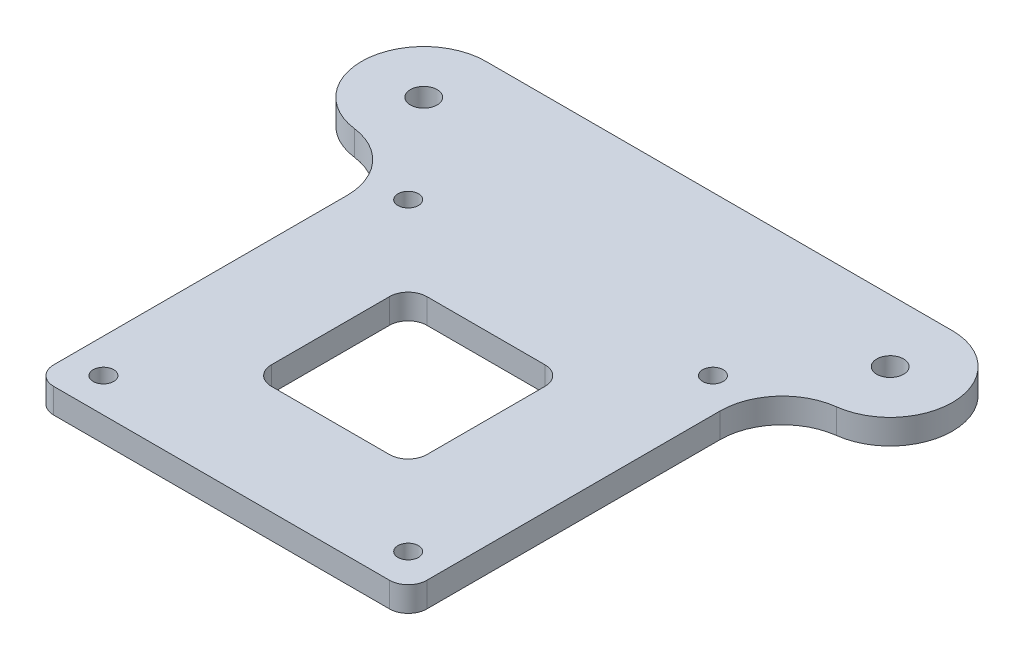
ISO-10303-21;
HEADER;
FILE_DESCRIPTION(('STEP AP214'),'2;1');
FILE_NAME('part.step','',(''),(''),'','','');
FILE_SCHEMA(('AUTOMOTIVE_DESIGN { 1 0 10303 214 1 1 1 1 }'));
ENDSEC;
DATA;
#1=APPLICATION_CONTEXT('core data for automotive mechanical design processes');
#2=APPLICATION_PROTOCOL_DEFINITION('international standard','automotive_design',2000,#1);
#3=PRODUCT_CONTEXT('',#1,'mechanical');
#4=PRODUCT('Part','Part','',(#3));
#5=PRODUCT_RELATED_PRODUCT_CATEGORY('part','',(#4));
#6=PRODUCT_DEFINITION_FORMATION('','',#4);
#7=PRODUCT_DEFINITION_CONTEXT('part definition',#1,'design');
#8=PRODUCT_DEFINITION('design','',#6,#7);
#9=PRODUCT_DEFINITION_SHAPE('','',#8);
#10=(LENGTH_UNIT() NAMED_UNIT(*) SI_UNIT(.MILLI.,.METRE.));
#11=(NAMED_UNIT(*) PLANE_ANGLE_UNIT() SI_UNIT($,.RADIAN.));
#12=(NAMED_UNIT(*) SI_UNIT($,.STERADIAN.) SOLID_ANGLE_UNIT());
#13=UNCERTAINTY_MEASURE_WITH_UNIT(LENGTH_MEASURE(1.E-05),#10,'distance_accuracy_value','');
#14=(GEOMETRIC_REPRESENTATION_CONTEXT(3) GLOBAL_UNCERTAINTY_ASSIGNED_CONTEXT((#13)) GLOBAL_UNIT_ASSIGNED_CONTEXT((#10,
#11,#12)) REPRESENTATION_CONTEXT('',''));
#15=CARTESIAN_POINT('',(0.,0.,0.));
#16=DIRECTION('',(0.,0.,1.));
#17=DIRECTION('',(1.,0.,0.));
#18=AXIS2_PLACEMENT_3D('',#15,#16,#17);
#19=CARTESIAN_POINT('',(0.,4.,0.));
#20=DIRECTION('',(0.,-1.,0.));
#21=DIRECTION('',(0.,0.,-1.));
#22=AXIS2_PLACEMENT_3D('',#19,#20,#21);
#23=PLANE('',#22);
#24=DIRECTION('',(0.,0.,-1.));
#25=VECTOR('',#24,1.);
#26=CARTESIAN_POINT('',(-12.5,4.,0.));
#27=LINE('',#26,#25);
#28=CARTESIAN_POINT('',(-12.5,4.,9.5));
#29=VERTEX_POINT('',#28);
#30=CARTESIAN_POINT('',(-12.5,4.,-9.5));
#31=VERTEX_POINT('',#30);
#32=EDGE_CURVE('E316',#29,#31,#27,.T.);
#33=ORIENTED_EDGE('',*,*,#32,.T.);
#34=CARTESIAN_POINT('',(-9.5,4.,-9.5));
#35=DIRECTION('',(0.,-1.,0.));
#36=DIRECTION('',(0.,0.,-1.));
#37=AXIS2_PLACEMENT_3D('',#34,#35,#36);
#38=CIRCLE('',#37,3.);
#39=CARTESIAN_POINT('',(-9.5,4.,-12.5));
#40=VERTEX_POINT('',#39);
#41=EDGE_CURVE('E45',#31,#40,#38,.T.);
#42=ORIENTED_EDGE('',*,*,#41,.T.);
#43=DIRECTION('',(1.,0.,0.));
#44=VECTOR('',#43,1.);
#45=CARTESIAN_POINT('',(0.,4.,-12.5));
#46=LINE('',#45,#44);
#47=CARTESIAN_POINT('',(9.5,4.,-12.5));
#48=VERTEX_POINT('',#47);
#49=EDGE_CURVE('E315',#40,#48,#46,.T.);
#50=ORIENTED_EDGE('',*,*,#49,.T.);
#51=CARTESIAN_POINT('',(9.5,4.,-9.5));
#52=DIRECTION('',(0.,-1.,0.));
#53=DIRECTION('',(0.,0.,-1.));
#54=AXIS2_PLACEMENT_3D('',#51,#52,#53);
#55=CIRCLE('',#54,3.);
#56=CARTESIAN_POINT('',(12.5,4.,-9.5));
#57=VERTEX_POINT('',#56);
#58=EDGE_CURVE('E303',#48,#57,#55,.T.);
#59=ORIENTED_EDGE('',*,*,#58,.T.);
#60=DIRECTION('',(0.,0.,1.));
#61=VECTOR('',#60,1.);
#62=CARTESIAN_POINT('',(12.5,4.,0.));
#63=LINE('',#62,#61);
#64=CARTESIAN_POINT('',(12.5,4.,9.5));
#65=VERTEX_POINT('',#64);
#66=EDGE_CURVE('E204',#57,#65,#63,.T.);
#67=ORIENTED_EDGE('',*,*,#66,.T.);
#68=CARTESIAN_POINT('',(9.5,4.,9.5));
#69=DIRECTION('',(0.,-1.,0.));
#70=DIRECTION('',(0.,0.,-1.));
#71=AXIS2_PLACEMENT_3D('',#68,#69,#70);
#72=CIRCLE('',#71,3.);
#73=CARTESIAN_POINT('',(9.5,4.,12.5));
#74=VERTEX_POINT('',#73);
#75=EDGE_CURVE('E307',#65,#74,#72,.T.);
#76=ORIENTED_EDGE('',*,*,#75,.T.);
#77=DIRECTION('',(-1.,0.,0.));
#78=VECTOR('',#77,1.);
#79=CARTESIAN_POINT('',(0.,4.,12.5));
#80=LINE('',#79,#78);
#81=CARTESIAN_POINT('',(-9.5,4.,12.5));
#82=VERTEX_POINT('',#81);
#83=EDGE_CURVE('E344',#74,#82,#80,.T.);
#84=ORIENTED_EDGE('',*,*,#83,.T.);
#85=CARTESIAN_POINT('',(-9.5,4.,9.5));
#86=DIRECTION('',(0.,-1.,0.));
#87=DIRECTION('',(0.,0.,-1.));
#88=AXIS2_PLACEMENT_3D('',#85,#86,#87);
#89=CIRCLE('',#88,3.);
#90=EDGE_CURVE('E59',#82,#29,#89,.T.);
#91=ORIENTED_EDGE('',*,*,#90,.T.);
#92=EDGE_LOOP('',(#33,#42,#50,#59,#67,#76,#84,#91));
#93=FACE_BOUND('',#92,.T.);
#94=DIRECTION('',(1.,0.,0.));
#95=VECTOR('',#94,1.);
#96=CARTESIAN_POINT('',(-30.,4.,30.));
#97=LINE('',#96,#95);
#98=CARTESIAN_POINT('',(-27.,4.,30.));
#99=VERTEX_POINT('',#98);
#100=CARTESIAN_POINT('',(27.,4.,30.));
#101=VERTEX_POINT('',#100);
#102=EDGE_CURVE('E239',#99,#101,#97,.T.);
#103=ORIENTED_EDGE('',*,*,#102,.T.);
#104=CARTESIAN_POINT('',(27.,4.,27.));
#105=DIRECTION('',(0.,-1.,0.));
#106=DIRECTION('',(0.,0.,-1.));
#107=AXIS2_PLACEMENT_3D('',#104,#105,#106);
#108=CIRCLE('',#107,3.);
#109=CARTESIAN_POINT('',(30.,4.,27.));
#110=VERTEX_POINT('',#109);
#111=EDGE_CURVE('E280',#101,#110,#108,.F.);
#112=ORIENTED_EDGE('',*,*,#111,.T.);
#113=DIRECTION('',(0.,0.,-1.));
#114=VECTOR('',#113,1.);
#115=CARTESIAN_POINT('',(30.,4.,30.));
#116=LINE('',#115,#114);
#117=CARTESIAN_POINT('',(30.,4.,-20.1568651670155));
#118=VERTEX_POINT('',#117);
#119=EDGE_CURVE('E233',#110,#118,#116,.T.);
#120=ORIENTED_EDGE('',*,*,#119,.T.);
#121=CARTESIAN_POINT('',(40.,4.,-20.1568651670156));
#122=DIRECTION('',(0.,-1.,0.));
#123=DIRECTION('',(0.,0.,-1.));
#124=AXIS2_PLACEMENT_3D('',#121,#122,#123);
#125=CIRCLE('',#124,10.);
#126=CARTESIAN_POINT('',(38.75,4.,-30.0784325835078));
#127=VERTEX_POINT('',#126);
#128=EDGE_CURVE('E260',#118,#127,#125,.T.);
#129=ORIENTED_EDGE('',*,*,#128,.T.);
#130=CARTESIAN_POINT('',(37.5,4.,-40.));
#131=DIRECTION('',(0.,1.,0.));
#132=DIRECTION('',(0.,0.,1.));
#133=AXIS2_PLACEMENT_3D('',#130,#131,#132);
#134=CIRCLE('',#133,10.);
#135=CARTESIAN_POINT('',(37.5,4.,-50.));
#136=VERTEX_POINT('',#135);
#137=EDGE_CURVE('E182',#127,#136,#134,.T.);
#138=ORIENTED_EDGE('',*,*,#137,.T.);
#139=DIRECTION('',(1.,0.,0.));
#140=VECTOR('',#139,1.);
#141=CARTESIAN_POINT('',(0.,4.,-50.));
#142=LINE('',#141,#140);
#143=CARTESIAN_POINT('',(-37.5,4.,-50.));
#144=VERTEX_POINT('',#143);
#145=EDGE_CURVE('E167',#144,#136,#142,.T.);
#146=ORIENTED_EDGE('',*,*,#145,.F.);
#147=CARTESIAN_POINT('',(-37.5,4.,-40.));
#148=DIRECTION('',(0.,1.,0.));
#149=DIRECTION('',(0.,0.,1.));
#150=AXIS2_PLACEMENT_3D('',#147,#148,#149);
#151=CIRCLE('',#150,10.);
#152=CARTESIAN_POINT('',(-38.75,4.,-30.0784325835078));
#153=VERTEX_POINT('',#152);
#154=EDGE_CURVE('E179',#144,#153,#151,.T.);
#155=ORIENTED_EDGE('',*,*,#154,.T.);
#156=CARTESIAN_POINT('',(-40.,4.,-20.1568651670156));
#157=DIRECTION('',(0.,-1.,0.));
#158=DIRECTION('',(0.,0.,-1.));
#159=AXIS2_PLACEMENT_3D('',#156,#157,#158);
#160=CIRCLE('',#159,10.);
#161=CARTESIAN_POINT('',(-30.,4.,-20.1568651670155));
#162=VERTEX_POINT('',#161);
#163=EDGE_CURVE('E264',#153,#162,#160,.T.);
#164=ORIENTED_EDGE('',*,*,#163,.T.);
#165=DIRECTION('',(0.,0.,1.));
#166=VECTOR('',#165,1.);
#167=CARTESIAN_POINT('',(-30.,4.,30.));
#168=LINE('',#167,#166);
#169=CARTESIAN_POINT('',(-30.,4.,27.));
#170=VERTEX_POINT('',#169);
#171=EDGE_CURVE('E235',#162,#170,#168,.T.);
#172=ORIENTED_EDGE('',*,*,#171,.T.);
#173=CARTESIAN_POINT('',(-27.,4.,27.));
#174=DIRECTION('',(0.,-1.,0.));
#175=DIRECTION('',(0.,0.,-1.));
#176=AXIS2_PLACEMENT_3D('',#173,#174,#175);
#177=CIRCLE('',#176,3.);
#178=EDGE_CURVE('E278',#170,#99,#177,.F.);
#179=ORIENTED_EDGE('',*,*,#178,.T.);
#180=EDGE_LOOP('',(#103,#112,#120,#129,#138,#146,#155,#164,#172,#179));
#181=FACE_BOUND('',#180,.T.);
#182=CARTESIAN_POINT('',(-24.5,4.,-24.5));
#183=DIRECTION('',(0.,1.,0.));
#184=DIRECTION('',(0.,0.,1.));
#185=AXIS2_PLACEMENT_3D('',#182,#183,#184);
#186=CIRCLE('',#185,1.65);
#187=CARTESIAN_POINT('',(-24.5,4.,-22.85));
#188=VERTEX_POINT('',#187);
#189=EDGE_CURVE('E227',#188,#188,#186,.T.);
#190=ORIENTED_EDGE('',*,*,#189,.F.);
#191=EDGE_LOOP('',(#190));
#192=FACE_BOUND('',#191,.T.);
#193=CARTESIAN_POINT('',(24.5,4.,-24.5));
#194=DIRECTION('',(0.,1.,0.));
#195=DIRECTION('',(0.,0.,1.));
#196=AXIS2_PLACEMENT_3D('',#193,#194,#195);
#197=CIRCLE('',#196,1.65);
#198=CARTESIAN_POINT('',(24.5,4.,-22.85));
#199=VERTEX_POINT('',#198);
#200=EDGE_CURVE('E221',#199,#199,#197,.T.);
#201=ORIENTED_EDGE('',*,*,#200,.F.);
#202=EDGE_LOOP('',(#201));
#203=FACE_BOUND('',#202,.T.);
#204=CARTESIAN_POINT('',(-24.5,4.,24.5));
#205=DIRECTION('',(0.,1.,0.));
#206=DIRECTION('',(0.,0.,1.));
#207=AXIS2_PLACEMENT_3D('',#204,#205,#206);
#208=CIRCLE('',#207,1.65);
#209=CARTESIAN_POINT('',(-24.5,4.,26.15));
#210=VERTEX_POINT('',#209);
#211=EDGE_CURVE('E215',#210,#210,#208,.T.);
#212=ORIENTED_EDGE('',*,*,#211,.F.);
#213=EDGE_LOOP('',(#212));
#214=FACE_BOUND('',#213,.T.);
#215=CARTESIAN_POINT('',(24.5,4.,24.5));
#216=DIRECTION('',(0.,1.,0.));
#217=DIRECTION('',(0.,0.,1.));
#218=AXIS2_PLACEMENT_3D('',#215,#216,#217);
#219=CIRCLE('',#218,1.65);
#220=CARTESIAN_POINT('',(24.5,4.,26.15));
#221=VERTEX_POINT('',#220);
#222=EDGE_CURVE('E209',#221,#221,#219,.T.);
#223=ORIENTED_EDGE('',*,*,#222,.F.);
#224=EDGE_LOOP('',(#223));
#225=FACE_BOUND('',#224,.T.);
#226=CARTESIAN_POINT('',(-37.5,4.,-40.));
#227=DIRECTION('',(0.,1.,0.));
#228=DIRECTION('',(0.,0.,1.));
#229=AXIS2_PLACEMENT_3D('',#226,#227,#228);
#230=CIRCLE('',#229,2.15);
#231=CARTESIAN_POINT('',(-37.5,4.,-37.85));
#232=VERTEX_POINT('',#231);
#233=EDGE_CURVE('E193',#232,#232,#230,.T.);
#234=ORIENTED_EDGE('',*,*,#233,.F.);
#235=EDGE_LOOP('',(#234));
#236=FACE_BOUND('',#235,.T.);
#237=CARTESIAN_POINT('',(37.5,4.,-40.));
#238=DIRECTION('',(0.,1.,0.));
#239=DIRECTION('',(0.,0.,1.));
#240=AXIS2_PLACEMENT_3D('',#237,#238,#239);
#241=CIRCLE('',#240,2.15);
#242=CARTESIAN_POINT('',(37.5,4.,-37.85));
#243=VERTEX_POINT('',#242);
#244=EDGE_CURVE('E196',#243,#243,#241,.T.);
#245=ORIENTED_EDGE('',*,*,#244,.F.);
#246=EDGE_LOOP('',(#245));
#247=FACE_BOUND('',#246,.T.);
#248=ADVANCED_FACE('F37',(#93,#181,#192,#203,#214,#225,#236,#247),#23,.F.);
#249=CARTESIAN_POINT('',(0.,0.,0.));
#250=DIRECTION('',(0.,-1.,0.));
#251=DIRECTION('',(0.,0.,-1.));
#252=AXIS2_PLACEMENT_3D('',#249,#250,#251);
#253=PLANE('',#252);
#254=DIRECTION('',(1.,0.,0.));
#255=VECTOR('',#254,1.);
#256=CARTESIAN_POINT('',(-12.5,0.,12.5));
#257=LINE('',#256,#255);
#258=CARTESIAN_POINT('',(-9.5,0.,12.5));
#259=VERTEX_POINT('',#258);
#260=CARTESIAN_POINT('',(9.5,0.,12.5));
#261=VERTEX_POINT('',#260);
#262=EDGE_CURVE('E322',#259,#261,#257,.T.);
#263=ORIENTED_EDGE('',*,*,#262,.T.);
#264=CARTESIAN_POINT('',(9.5,0.,9.5));
#265=DIRECTION('',(0.,-1.,0.));
#266=DIRECTION('',(0.,0.,-1.));
#267=AXIS2_PLACEMENT_3D('',#264,#265,#266);
#268=CIRCLE('',#267,3.);
#269=CARTESIAN_POINT('',(12.5,0.,9.5));
#270=VERTEX_POINT('',#269);
#271=EDGE_CURVE('E309',#261,#270,#268,.F.);
#272=ORIENTED_EDGE('',*,*,#271,.T.);
#273=DIRECTION('',(0.,0.,-1.));
#274=VECTOR('',#273,1.);
#275=CARTESIAN_POINT('',(12.5,0.,12.5));
#276=LINE('',#275,#274);
#277=CARTESIAN_POINT('',(12.5,0.,-9.5));
#278=VERTEX_POINT('',#277);
#279=EDGE_CURVE('E339',#270,#278,#276,.T.);
#280=ORIENTED_EDGE('',*,*,#279,.T.);
#281=CARTESIAN_POINT('',(9.5,0.,-9.5));
#282=DIRECTION('',(0.,-1.,0.));
#283=DIRECTION('',(0.,0.,-1.));
#284=AXIS2_PLACEMENT_3D('',#281,#282,#283);
#285=CIRCLE('',#284,3.);
#286=CARTESIAN_POINT('',(9.5,0.,-12.5));
#287=VERTEX_POINT('',#286);
#288=EDGE_CURVE('E305',#278,#287,#285,.F.);
#289=ORIENTED_EDGE('',*,*,#288,.T.);
#290=DIRECTION('',(-1.,0.,0.));
#291=VECTOR('',#290,1.);
#292=CARTESIAN_POINT('',(-12.5,0.,-12.5));
#293=LINE('',#292,#291);
#294=CARTESIAN_POINT('',(-9.5,0.,-12.5));
#295=VERTEX_POINT('',#294);
#296=EDGE_CURVE('E333',#287,#295,#293,.T.);
#297=ORIENTED_EDGE('',*,*,#296,.T.);
#298=CARTESIAN_POINT('',(-9.5,0.,-9.5));
#299=DIRECTION('',(0.,-1.,0.));
#300=DIRECTION('',(0.,0.,-1.));
#301=AXIS2_PLACEMENT_3D('',#298,#299,#300);
#302=CIRCLE('',#301,3.);
#303=CARTESIAN_POINT('',(-12.5,0.,-9.5));
#304=VERTEX_POINT('',#303);
#305=EDGE_CURVE('E11',#295,#304,#302,.F.);
#306=ORIENTED_EDGE('',*,*,#305,.T.);
#307=DIRECTION('',(0.,0.,1.));
#308=VECTOR('',#307,1.);
#309=CARTESIAN_POINT('',(-12.5,0.,12.5));
#310=LINE('',#309,#308);
#311=CARTESIAN_POINT('',(-12.5,0.,9.5));
#312=VERTEX_POINT('',#311);
#313=EDGE_CURVE('E331',#304,#312,#310,.T.);
#314=ORIENTED_EDGE('',*,*,#313,.T.);
#315=CARTESIAN_POINT('',(-9.5,0.,9.5));
#316=DIRECTION('',(0.,-1.,0.));
#317=DIRECTION('',(0.,0.,-1.));
#318=AXIS2_PLACEMENT_3D('',#315,#316,#317);
#319=CIRCLE('',#318,3.);
#320=EDGE_CURVE('E312',#312,#259,#319,.F.);
#321=ORIENTED_EDGE('',*,*,#320,.T.);
#322=EDGE_LOOP('',(#263,#272,#280,#289,#297,#306,#314,#321));
#323=FACE_BOUND('',#322,.T.);
#324=CARTESIAN_POINT('',(-24.5,0.,24.5));
#325=DIRECTION('',(0.,1.,0.));
#326=DIRECTION('',(0.,0.,1.));
#327=AXIS2_PLACEMENT_3D('',#324,#325,#326);
#328=CIRCLE('',#327,1.65);
#329=CARTESIAN_POINT('',(-24.5,0.,26.15));
#330=VERTEX_POINT('',#329);
#331=EDGE_CURVE('E212',#330,#330,#328,.T.);
#332=ORIENTED_EDGE('',*,*,#331,.T.);
#333=EDGE_LOOP('',(#332));
#334=FACE_BOUND('',#333,.T.);
#335=CARTESIAN_POINT('',(-24.5,0.,-24.5));
#336=DIRECTION('',(0.,1.,0.));
#337=DIRECTION('',(0.,0.,1.));
#338=AXIS2_PLACEMENT_3D('',#335,#336,#337);
#339=CIRCLE('',#338,1.65);
#340=CARTESIAN_POINT('',(-24.5,0.,-22.85));
#341=VERTEX_POINT('',#340);
#342=EDGE_CURVE('E224',#341,#341,#339,.T.);
#343=ORIENTED_EDGE('',*,*,#342,.T.);
#344=EDGE_LOOP('',(#343));
#345=FACE_BOUND('',#344,.T.);
#346=DIRECTION('',(0.,0.,-1.));
#347=VECTOR('',#346,1.);
#348=CARTESIAN_POINT('',(30.,0.,30.));
#349=LINE('',#348,#347);
#350=CARTESIAN_POINT('',(30.,0.,27.));
#351=VERTEX_POINT('',#350);
#352=CARTESIAN_POINT('',(30.,0.,-20.1568651670155));
#353=VERTEX_POINT('',#352);
#354=EDGE_CURVE('E230',#351,#353,#349,.T.);
#355=ORIENTED_EDGE('',*,*,#354,.F.);
#356=CARTESIAN_POINT('',(27.,0.,27.));
#357=DIRECTION('',(0.,-1.,0.));
#358=DIRECTION('',(0.,0.,-1.));
#359=AXIS2_PLACEMENT_3D('',#356,#357,#358);
#360=CIRCLE('',#359,3.);
#361=CARTESIAN_POINT('',(27.,0.,30.));
#362=VERTEX_POINT('',#361);
#363=EDGE_CURVE('E271',#351,#362,#360,.T.);
#364=ORIENTED_EDGE('',*,*,#363,.T.);
#365=DIRECTION('',(1.,0.,0.));
#366=VECTOR('',#365,1.);
#367=CARTESIAN_POINT('',(-30.,0.,30.));
#368=LINE('',#367,#366);
#369=CARTESIAN_POINT('',(-27.,0.,30.));
#370=VERTEX_POINT('',#369);
#371=EDGE_CURVE('E236',#370,#362,#368,.T.);
#372=ORIENTED_EDGE('',*,*,#371,.F.);
#373=CARTESIAN_POINT('',(-27.,0.,27.));
#374=DIRECTION('',(0.,-1.,0.));
#375=DIRECTION('',(0.,0.,-1.));
#376=AXIS2_PLACEMENT_3D('',#373,#374,#375);
#377=CIRCLE('',#376,3.);
#378=CARTESIAN_POINT('',(-30.,0.,27.));
#379=VERTEX_POINT('',#378);
#380=EDGE_CURVE('E269',#370,#379,#377,.T.);
#381=ORIENTED_EDGE('',*,*,#380,.T.);
#382=DIRECTION('',(0.,0.,1.));
#383=VECTOR('',#382,1.);
#384=CARTESIAN_POINT('',(-30.,0.,30.));
#385=LINE('',#384,#383);
#386=CARTESIAN_POINT('',(-30.,0.,-20.1568651670155));
#387=VERTEX_POINT('',#386);
#388=EDGE_CURVE('E243',#387,#379,#385,.T.);
#389=ORIENTED_EDGE('',*,*,#388,.F.);
#390=CARTESIAN_POINT('',(-40.,0.,-20.1568651670156));
#391=DIRECTION('',(0.,-1.,0.));
#392=DIRECTION('',(0.,0.,-1.));
#393=AXIS2_PLACEMENT_3D('',#390,#391,#392);
#394=CIRCLE('',#393,10.);
#395=CARTESIAN_POINT('',(-38.75,0.,-30.0784325835078));
#396=VERTEX_POINT('',#395);
#397=EDGE_CURVE('E262',#387,#396,#394,.F.);
#398=ORIENTED_EDGE('',*,*,#397,.T.);
#399=CARTESIAN_POINT('',(-37.5,0.,-40.));
#400=DIRECTION('',(0.,-1.,0.));
#401=DIRECTION('',(0.,0.,-1.));
#402=AXIS2_PLACEMENT_3D('',#399,#400,#401);
#403=CIRCLE('',#402,10.);
#404=CARTESIAN_POINT('',(-37.5,0.,-50.));
#405=VERTEX_POINT('',#404);
#406=EDGE_CURVE('E173',#405,#396,#403,.F.);
#407=ORIENTED_EDGE('',*,*,#406,.F.);
#408=DIRECTION('',(1.,0.,0.));
#409=VECTOR('',#408,1.);
#410=CARTESIAN_POINT('',(0.,0.,-50.));
#411=LINE('',#410,#409);
#412=CARTESIAN_POINT('',(37.5,0.,-50.));
#413=VERTEX_POINT('',#412);
#414=EDGE_CURVE('E169',#405,#413,#411,.T.);
#415=ORIENTED_EDGE('',*,*,#414,.T.);
#416=CARTESIAN_POINT('',(37.5,0.,-40.));
#417=DIRECTION('',(0.,-1.,0.));
#418=DIRECTION('',(0.,0.,-1.));
#419=AXIS2_PLACEMENT_3D('',#416,#417,#418);
#420=CIRCLE('',#419,10.);
#421=CARTESIAN_POINT('',(38.75,0.,-30.0784325835078));
#422=VERTEX_POINT('',#421);
#423=EDGE_CURVE('E184',#422,#413,#420,.F.);
#424=ORIENTED_EDGE('',*,*,#423,.F.);
#425=CARTESIAN_POINT('',(40.,0.,-20.1568651670156));
#426=DIRECTION('',(0.,-1.,0.));
#427=DIRECTION('',(0.,0.,-1.));
#428=AXIS2_PLACEMENT_3D('',#425,#426,#427);
#429=CIRCLE('',#428,10.);
#430=EDGE_CURVE('E257',#422,#353,#429,.F.);
#431=ORIENTED_EDGE('',*,*,#430,.T.);
#432=EDGE_LOOP('',(#355,#364,#372,#381,#389,#398,#407,#415,#424,#431));
#433=FACE_BOUND('',#432,.T.);
#434=CARTESIAN_POINT('',(24.5,0.,-24.5));
#435=DIRECTION('',(0.,1.,0.));
#436=DIRECTION('',(0.,0.,1.));
#437=AXIS2_PLACEMENT_3D('',#434,#435,#436);
#438=CIRCLE('',#437,1.65);
#439=CARTESIAN_POINT('',(24.5,0.,-22.85));
#440=VERTEX_POINT('',#439);
#441=EDGE_CURVE('E218',#440,#440,#438,.T.);
#442=ORIENTED_EDGE('',*,*,#441,.T.);
#443=EDGE_LOOP('',(#442));
#444=FACE_BOUND('',#443,.T.);
#445=CARTESIAN_POINT('',(24.5,0.,24.5));
#446=DIRECTION('',(0.,1.,0.));
#447=DIRECTION('',(0.,0.,1.));
#448=AXIS2_PLACEMENT_3D('',#445,#446,#447);
#449=CIRCLE('',#448,1.65);
#450=CARTESIAN_POINT('',(24.5,0.,26.15));
#451=VERTEX_POINT('',#450);
#452=EDGE_CURVE('E201',#451,#451,#449,.T.);
#453=ORIENTED_EDGE('',*,*,#452,.T.);
#454=EDGE_LOOP('',(#453));
#455=FACE_BOUND('',#454,.T.);
#456=CARTESIAN_POINT('',(37.5,0.,-40.));
#457=DIRECTION('',(0.,-1.,0.));
#458=DIRECTION('',(0.,0.,-1.));
#459=AXIS2_PLACEMENT_3D('',#456,#457,#458);
#460=CIRCLE('',#459,2.15);
#461=CARTESIAN_POINT('',(37.5,0.,-42.15));
#462=VERTEX_POINT('',#461);
#463=EDGE_CURVE('E199',#462,#462,#460,.F.);
#464=ORIENTED_EDGE('',*,*,#463,.T.);
#465=EDGE_LOOP('',(#464));
#466=FACE_BOUND('',#465,.T.);
#467=CARTESIAN_POINT('',(-37.5,0.,-40.));
#468=DIRECTION('',(0.,-1.,0.));
#469=DIRECTION('',(0.,0.,-1.));
#470=AXIS2_PLACEMENT_3D('',#467,#468,#469);
#471=CIRCLE('',#470,2.15);
#472=CARTESIAN_POINT('',(-37.5,0.,-42.15));
#473=VERTEX_POINT('',#472);
#474=EDGE_CURVE('E189',#473,#473,#471,.F.);
#475=ORIENTED_EDGE('',*,*,#474,.T.);
#476=EDGE_LOOP('',(#475));
#477=FACE_BOUND('',#476,.T.);
#478=ADVANCED_FACE('F329',(#323,#334,#345,#433,#444,#455,#466,#477),#253,.T.);
#479=CARTESIAN_POINT('',(30.,4.,30.));
#480=DIRECTION('',(-1.,0.,0.));
#481=DIRECTION('',(0.,0.,1.));
#482=AXIS2_PLACEMENT_3D('',#479,#480,#481);
#483=PLANE('',#482);
#484=ORIENTED_EDGE('',*,*,#119,.F.);
#485=DIRECTION('',(0.,-1.,0.));
#486=VECTOR('',#485,1.);
#487=CARTESIAN_POINT('',(30.,4.,27.));
#488=LINE('',#487,#486);
#489=EDGE_CURVE('E266',#110,#351,#488,.T.);
#490=ORIENTED_EDGE('',*,*,#489,.T.);
#491=ORIENTED_EDGE('',*,*,#354,.T.);
#492=DIRECTION('',(0.,1.,0.));
#493=VECTOR('',#492,1.);
#494=CARTESIAN_POINT('',(30.,4.,-20.1568651670155));
#495=LINE('',#494,#493);
#496=EDGE_CURVE('E250',#353,#118,#495,.T.);
#497=ORIENTED_EDGE('',*,*,#496,.T.);
#498=EDGE_LOOP('',(#484,#490,#491,#497));
#499=FACE_BOUND('',#498,.T.);
#500=ADVANCED_FACE('F361',(#499),#483,.F.);
#501=CARTESIAN_POINT('',(-30.,4.,30.));
#502=DIRECTION('',(1.,0.,0.));
#503=DIRECTION('',(0.,0.,-1.));
#504=AXIS2_PLACEMENT_3D('',#501,#502,#503);
#505=PLANE('',#504);
#506=ORIENTED_EDGE('',*,*,#388,.T.);
#507=DIRECTION('',(0.,-1.,0.));
#508=VECTOR('',#507,1.);
#509=CARTESIAN_POINT('',(-30.,4.,27.));
#510=LINE('',#509,#508);
#511=EDGE_CURVE('E282',#379,#170,#510,.F.);
#512=ORIENTED_EDGE('',*,*,#511,.T.);
#513=ORIENTED_EDGE('',*,*,#171,.F.);
#514=DIRECTION('',(0.,1.,0.));
#515=VECTOR('',#514,1.);
#516=CARTESIAN_POINT('',(-30.,4.,-20.1568651670155));
#517=LINE('',#516,#515);
#518=EDGE_CURVE('E253',#162,#387,#517,.F.);
#519=ORIENTED_EDGE('',*,*,#518,.T.);
#520=EDGE_LOOP('',(#506,#512,#513,#519));
#521=FACE_BOUND('',#520,.T.);
#522=ADVANCED_FACE('F370',(#521),#505,.F.);
#523=CARTESIAN_POINT('',(-30.,4.,30.));
#524=DIRECTION('',(0.,0.,-1.));
#525=DIRECTION('',(-1.,0.,0.));
#526=AXIS2_PLACEMENT_3D('',#523,#524,#525);
#527=PLANE('',#526);
#528=ORIENTED_EDGE('',*,*,#371,.T.);
#529=DIRECTION('',(0.,-1.,0.));
#530=VECTOR('',#529,1.);
#531=CARTESIAN_POINT('',(27.,4.,30.));
#532=LINE('',#531,#530);
#533=EDGE_CURVE('E276',#362,#101,#532,.F.);
#534=ORIENTED_EDGE('',*,*,#533,.T.);
#535=ORIENTED_EDGE('',*,*,#102,.F.);
#536=DIRECTION('',(0.,-1.,0.));
#537=VECTOR('',#536,1.);
#538=CARTESIAN_POINT('',(-27.,4.,30.));
#539=LINE('',#538,#537);
#540=EDGE_CURVE('E273',#99,#370,#539,.T.);
#541=ORIENTED_EDGE('',*,*,#540,.T.);
#542=EDGE_LOOP('',(#528,#534,#535,#541));
#543=FACE_BOUND('',#542,.T.);
#544=ADVANCED_FACE('F367',(#543),#527,.F.);
#545=CARTESIAN_POINT('',(-24.5,4.,-24.5));
#546=DIRECTION('',(0.,-1.,0.));
#547=DIRECTION('',(0.,0.,-1.));
#548=AXIS2_PLACEMENT_3D('',#545,#546,#547);
#549=CYLINDRICAL_SURFACE('',#548,1.65);
#550=ORIENTED_EDGE('',*,*,#189,.T.);
#551=EDGE_LOOP('',(#550));
#552=FACE_BOUND('',#551,.T.);
#553=ORIENTED_EDGE('',*,*,#342,.F.);
#554=EDGE_LOOP('',(#553));
#555=FACE_BOUND('',#554,.T.);
#556=ADVANCED_FACE('F364',(#552,#555),#549,.F.);
#557=CARTESIAN_POINT('',(24.5,4.,-24.5));
#558=DIRECTION('',(0.,-1.,0.));
#559=DIRECTION('',(0.,0.,-1.));
#560=AXIS2_PLACEMENT_3D('',#557,#558,#559);
#561=CYLINDRICAL_SURFACE('',#560,1.65);
#562=ORIENTED_EDGE('',*,*,#200,.T.);
#563=EDGE_LOOP('',(#562));
#564=FACE_BOUND('',#563,.T.);
#565=ORIENTED_EDGE('',*,*,#441,.F.);
#566=EDGE_LOOP('',(#565));
#567=FACE_BOUND('',#566,.T.);
#568=ADVANCED_FACE('F450',(#564,#567),#561,.F.);
#569=CARTESIAN_POINT('',(-24.5,4.,24.5));
#570=DIRECTION('',(0.,-1.,0.));
#571=DIRECTION('',(0.,0.,-1.));
#572=AXIS2_PLACEMENT_3D('',#569,#570,#571);
#573=CYLINDRICAL_SURFACE('',#572,1.65);
#574=ORIENTED_EDGE('',*,*,#211,.T.);
#575=EDGE_LOOP('',(#574));
#576=FACE_BOUND('',#575,.T.);
#577=ORIENTED_EDGE('',*,*,#331,.F.);
#578=EDGE_LOOP('',(#577));
#579=FACE_BOUND('',#578,.T.);
#580=ADVANCED_FACE('F447',(#576,#579),#573,.F.);
#581=CARTESIAN_POINT('',(24.5,4.,24.5));
#582=DIRECTION('',(0.,-1.,0.));
#583=DIRECTION('',(0.,0.,-1.));
#584=AXIS2_PLACEMENT_3D('',#581,#582,#583);
#585=CYLINDRICAL_SURFACE('',#584,1.65);
#586=ORIENTED_EDGE('',*,*,#222,.T.);
#587=EDGE_LOOP('',(#586));
#588=FACE_BOUND('',#587,.T.);
#589=ORIENTED_EDGE('',*,*,#452,.F.);
#590=EDGE_LOOP('',(#589));
#591=FACE_BOUND('',#590,.T.);
#592=ADVANCED_FACE('F442',(#588,#591),#585,.F.);
#593=CARTESIAN_POINT('',(-37.5,-124.197423483742,-40.));
#594=DIRECTION('',(0.,1.,0.));
#595=DIRECTION('',(0.,0.,1.));
#596=AXIS2_PLACEMENT_3D('',#593,#594,#595);
#597=CYLINDRICAL_SURFACE('',#596,10.);
#598=ORIENTED_EDGE('',*,*,#406,.T.);
#599=DIRECTION('',(0.,1.,0.));
#600=VECTOR('',#599,1.);
#601=CARTESIAN_POINT('',(-38.75,-124.197423483742,-30.0784325835078));
#602=LINE('',#601,#600);
#603=EDGE_CURVE('E188',#396,#153,#602,.T.);
#604=ORIENTED_EDGE('',*,*,#603,.T.);
#605=ORIENTED_EDGE('',*,*,#154,.F.);
#606=DIRECTION('',(0.,1.,0.));
#607=VECTOR('',#606,1.);
#608=CARTESIAN_POINT('',(-37.5,-124.197423483742,-50.));
#609=LINE('',#608,#607);
#610=EDGE_CURVE('E163',#405,#144,#609,.T.);
#611=ORIENTED_EDGE('',*,*,#610,.F.);
#612=EDGE_LOOP('',(#598,#604,#605,#611));
#613=FACE_BOUND('',#612,.T.);
#614=ADVANCED_FACE('F186',(#613),#597,.T.);
#615=CARTESIAN_POINT('',(0.,-124.197423483742,-50.));
#616=DIRECTION('',(0.,0.,1.));
#617=DIRECTION('',(1.,0.,0.));
#618=AXIS2_PLACEMENT_3D('',#615,#616,#617);
#619=PLANE('',#618);
#620=ORIENTED_EDGE('',*,*,#414,.F.);
#621=ORIENTED_EDGE('',*,*,#610,.T.);
#622=ORIENTED_EDGE('',*,*,#145,.T.);
#623=DIRECTION('',(0.,1.,0.));
#624=VECTOR('',#623,1.);
#625=CARTESIAN_POINT('',(37.5,-124.197423483742,-50.));
#626=LINE('',#625,#624);
#627=EDGE_CURVE('E206',#413,#136,#626,.T.);
#628=ORIENTED_EDGE('',*,*,#627,.F.);
#629=EDGE_LOOP('',(#620,#621,#622,#628));
#630=FACE_BOUND('',#629,.T.);
#631=ADVANCED_FACE('F165',(#630),#619,.F.);
#632=CARTESIAN_POINT('',(37.5,-124.197423483742,-40.));
#633=DIRECTION('',(0.,1.,0.));
#634=DIRECTION('',(0.,0.,1.));
#635=AXIS2_PLACEMENT_3D('',#632,#633,#634);
#636=CYLINDRICAL_SURFACE('',#635,10.);
#637=ORIENTED_EDGE('',*,*,#137,.F.);
#638=DIRECTION('',(0.,1.,0.));
#639=VECTOR('',#638,1.);
#640=CARTESIAN_POINT('',(38.75,-124.197423483742,-30.0784325835078));
#641=LINE('',#640,#639);
#642=EDGE_CURVE('E241',#127,#422,#641,.F.);
#643=ORIENTED_EDGE('',*,*,#642,.T.);
#644=ORIENTED_EDGE('',*,*,#423,.T.);
#645=ORIENTED_EDGE('',*,*,#627,.T.);
#646=EDGE_LOOP('',(#637,#643,#644,#645));
#647=FACE_BOUND('',#646,.T.);
#648=ADVANCED_FACE('F434',(#647),#636,.T.);
#649=CARTESIAN_POINT('',(37.5,-124.197423483742,-40.));
#650=DIRECTION('',(0.,1.,0.));
#651=DIRECTION('',(0.,0.,1.));
#652=AXIS2_PLACEMENT_3D('',#649,#650,#651);
#653=CYLINDRICAL_SURFACE('',#652,2.15);
#654=ORIENTED_EDGE('',*,*,#244,.T.);
#655=EDGE_LOOP('',(#654));
#656=FACE_BOUND('',#655,.T.);
#657=ORIENTED_EDGE('',*,*,#463,.F.);
#658=EDGE_LOOP('',(#657));
#659=FACE_BOUND('',#658,.T.);
#660=ADVANCED_FACE('F353',(#656,#659),#653,.F.);
#661=CARTESIAN_POINT('',(-37.5,-124.197423483742,-40.));
#662=DIRECTION('',(0.,1.,0.));
#663=DIRECTION('',(0.,0.,1.));
#664=AXIS2_PLACEMENT_3D('',#661,#662,#663);
#665=CYLINDRICAL_SURFACE('',#664,2.15);
#666=ORIENTED_EDGE('',*,*,#233,.T.);
#667=EDGE_LOOP('',(#666));
#668=FACE_BOUND('',#667,.T.);
#669=ORIENTED_EDGE('',*,*,#474,.F.);
#670=EDGE_LOOP('',(#669));
#671=FACE_BOUND('',#670,.T.);
#672=ADVANCED_FACE('F382',(#668,#671),#665,.F.);
#673=CARTESIAN_POINT('',(40.,-124.197423483742,-20.1568651670156));
#674=DIRECTION('',(0.,1.,0.));
#675=DIRECTION('',(0.,0.,1.));
#676=AXIS2_PLACEMENT_3D('',#673,#674,#675);
#677=CYLINDRICAL_SURFACE('',#676,10.);
#678=ORIENTED_EDGE('',*,*,#128,.F.);
#679=ORIENTED_EDGE('',*,*,#496,.F.);
#680=ORIENTED_EDGE('',*,*,#430,.F.);
#681=ORIENTED_EDGE('',*,*,#642,.F.);
#682=EDGE_LOOP('',(#678,#679,#680,#681));
#683=FACE_BOUND('',#682,.T.);
#684=ADVANCED_FACE('F378',(#683),#677,.F.);
#685=CARTESIAN_POINT('',(-40.,-124.197423483742,-20.1568651670156));
#686=DIRECTION('',(0.,1.,0.));
#687=DIRECTION('',(0.,0.,1.));
#688=AXIS2_PLACEMENT_3D('',#685,#686,#687);
#689=CYLINDRICAL_SURFACE('',#688,10.);
#690=ORIENTED_EDGE('',*,*,#163,.F.);
#691=ORIENTED_EDGE('',*,*,#603,.F.);
#692=ORIENTED_EDGE('',*,*,#397,.F.);
#693=ORIENTED_EDGE('',*,*,#518,.F.);
#694=EDGE_LOOP('',(#690,#691,#692,#693));
#695=FACE_BOUND('',#694,.T.);
#696=ADVANCED_FACE('F381',(#695),#689,.F.);
#697=CARTESIAN_POINT('',(27.,4.,27.));
#698=DIRECTION('',(0.,-1.,0.));
#699=DIRECTION('',(0.,0.,-1.));
#700=AXIS2_PLACEMENT_3D('',#697,#698,#699);
#701=CYLINDRICAL_SURFACE('',#700,3.);
#702=ORIENTED_EDGE('',*,*,#111,.F.);
#703=ORIENTED_EDGE('',*,*,#533,.F.);
#704=ORIENTED_EDGE('',*,*,#363,.F.);
#705=ORIENTED_EDGE('',*,*,#489,.F.);
#706=EDGE_LOOP('',(#702,#703,#704,#705));
#707=FACE_BOUND('',#706,.T.);
#708=ADVANCED_FACE('F386',(#707),#701,.T.);
#709=CARTESIAN_POINT('',(-27.,4.,27.));
#710=DIRECTION('',(0.,-1.,0.));
#711=DIRECTION('',(0.,0.,-1.));
#712=AXIS2_PLACEMENT_3D('',#709,#710,#711);
#713=CYLINDRICAL_SURFACE('',#712,3.);
#714=ORIENTED_EDGE('',*,*,#178,.F.);
#715=ORIENTED_EDGE('',*,*,#511,.F.);
#716=ORIENTED_EDGE('',*,*,#380,.F.);
#717=ORIENTED_EDGE('',*,*,#540,.F.);
#718=EDGE_LOOP('',(#714,#715,#716,#717));
#719=FACE_BOUND('',#718,.T.);
#720=ADVANCED_FACE('F390',(#719),#713,.T.);
#721=CARTESIAN_POINT('',(12.5,0.,12.5));
#722=DIRECTION('',(1.,0.,0.));
#723=DIRECTION('',(0.,0.,-1.));
#724=AXIS2_PLACEMENT_3D('',#721,#722,#723);
#725=PLANE('',#724);
#726=ORIENTED_EDGE('',*,*,#66,.F.);
#727=DIRECTION('',(0.,1.,0.));
#728=VECTOR('',#727,1.);
#729=CARTESIAN_POINT('',(12.5,0.,-9.5));
#730=LINE('',#729,#728);
#731=EDGE_CURVE('E292',#57,#278,#730,.F.);
#732=ORIENTED_EDGE('',*,*,#731,.T.);
#733=ORIENTED_EDGE('',*,*,#279,.F.);
#734=DIRECTION('',(0.,1.,0.));
#735=VECTOR('',#734,1.);
#736=CARTESIAN_POINT('',(12.5,4.,9.5));
#737=LINE('',#736,#735);
#738=EDGE_CURVE('E289',#270,#65,#737,.T.);
#739=ORIENTED_EDGE('',*,*,#738,.T.);
#740=EDGE_LOOP('',(#726,#732,#733,#739));
#741=FACE_BOUND('',#740,.T.);
#742=ADVANCED_FACE('F394',(#741),#725,.F.);
#743=CARTESIAN_POINT('',(-12.5,0.,12.5));
#744=DIRECTION('',(0.,0.,1.));
#745=DIRECTION('',(1.,0.,0.));
#746=AXIS2_PLACEMENT_3D('',#743,#744,#745);
#747=PLANE('',#746);
#748=ORIENTED_EDGE('',*,*,#83,.F.);
#749=DIRECTION('',(0.,1.,0.));
#750=VECTOR('',#749,1.);
#751=CARTESIAN_POINT('',(9.5,0.,12.5));
#752=LINE('',#751,#750);
#753=EDGE_CURVE('E297',#74,#261,#752,.F.);
#754=ORIENTED_EDGE('',*,*,#753,.T.);
#755=ORIENTED_EDGE('',*,*,#262,.F.);
#756=DIRECTION('',(0.,1.,0.));
#757=VECTOR('',#756,1.);
#758=CARTESIAN_POINT('',(-9.5,4.,12.5));
#759=LINE('',#758,#757);
#760=EDGE_CURVE('E294',#259,#82,#759,.T.);
#761=ORIENTED_EDGE('',*,*,#760,.T.);
#762=EDGE_LOOP('',(#748,#754,#755,#761));
#763=FACE_BOUND('',#762,.T.);
#764=ADVANCED_FACE('F414',(#763),#747,.F.);
#765=CARTESIAN_POINT('',(-12.5,0.,12.5));
#766=DIRECTION('',(-1.,0.,0.));
#767=DIRECTION('',(0.,0.,1.));
#768=AXIS2_PLACEMENT_3D('',#765,#766,#767);
#769=PLANE('',#768);
#770=ORIENTED_EDGE('',*,*,#32,.F.);
#771=DIRECTION('',(0.,1.,0.));
#772=VECTOR('',#771,1.);
#773=CARTESIAN_POINT('',(-12.5,0.,9.5));
#774=LINE('',#773,#772);
#775=EDGE_CURVE('E301',#29,#312,#774,.F.);
#776=ORIENTED_EDGE('',*,*,#775,.T.);
#777=ORIENTED_EDGE('',*,*,#313,.F.);
#778=DIRECTION('',(0.,1.,0.));
#779=VECTOR('',#778,1.);
#780=CARTESIAN_POINT('',(-12.5,4.,-9.5));
#781=LINE('',#780,#779);
#782=EDGE_CURVE('E299',#304,#31,#781,.T.);
#783=ORIENTED_EDGE('',*,*,#782,.T.);
#784=EDGE_LOOP('',(#770,#776,#777,#783));
#785=FACE_BOUND('',#784,.T.);
#786=ADVANCED_FACE('F335',(#785),#769,.F.);
#787=CARTESIAN_POINT('',(-12.5,0.,-12.5));
#788=DIRECTION('',(0.,0.,-1.));
#789=DIRECTION('',(-1.,0.,0.));
#790=AXIS2_PLACEMENT_3D('',#787,#788,#789);
#791=PLANE('',#790);
#792=ORIENTED_EDGE('',*,*,#296,.F.);
#793=DIRECTION('',(0.,1.,0.));
#794=VECTOR('',#793,1.);
#795=CARTESIAN_POINT('',(9.5,4.,-12.5));
#796=LINE('',#795,#794);
#797=EDGE_CURVE('E286',#287,#48,#796,.T.);
#798=ORIENTED_EDGE('',*,*,#797,.T.);
#799=ORIENTED_EDGE('',*,*,#49,.F.);
#800=DIRECTION('',(0.,1.,0.));
#801=VECTOR('',#800,1.);
#802=CARTESIAN_POINT('',(-9.5,0.,-12.5));
#803=LINE('',#802,#801);
#804=EDGE_CURVE('E284',#40,#295,#803,.F.);
#805=ORIENTED_EDGE('',*,*,#804,.T.);
#806=EDGE_LOOP('',(#792,#798,#799,#805));
#807=FACE_BOUND('',#806,.T.);
#808=ADVANCED_FACE('F319',(#807),#791,.F.);
#809=CARTESIAN_POINT('',(9.5,0.,-9.5));
#810=DIRECTION('',(0.,-1.,0.));
#811=DIRECTION('',(0.,0.,-1.));
#812=AXIS2_PLACEMENT_3D('',#809,#810,#811);
#813=CYLINDRICAL_SURFACE('',#812,3.);
#814=ORIENTED_EDGE('',*,*,#288,.F.);
#815=ORIENTED_EDGE('',*,*,#731,.F.);
#816=ORIENTED_EDGE('',*,*,#58,.F.);
#817=ORIENTED_EDGE('',*,*,#797,.F.);
#818=EDGE_LOOP('',(#814,#815,#816,#817));
#819=FACE_BOUND('',#818,.T.);
#820=ADVANCED_FACE('F396',(#819),#813,.F.);
#821=CARTESIAN_POINT('',(9.5,0.,9.5));
#822=DIRECTION('',(0.,-1.,0.));
#823=DIRECTION('',(0.,0.,-1.));
#824=AXIS2_PLACEMENT_3D('',#821,#822,#823);
#825=CYLINDRICAL_SURFACE('',#824,3.);
#826=ORIENTED_EDGE('',*,*,#271,.F.);
#827=ORIENTED_EDGE('',*,*,#753,.F.);
#828=ORIENTED_EDGE('',*,*,#75,.F.);
#829=ORIENTED_EDGE('',*,*,#738,.F.);
#830=EDGE_LOOP('',(#826,#827,#828,#829));
#831=FACE_BOUND('',#830,.T.);
#832=ADVANCED_FACE('F399',(#831),#825,.F.);
#833=CARTESIAN_POINT('',(-9.5,0.,9.5));
#834=DIRECTION('',(0.,-1.,0.));
#835=DIRECTION('',(0.,0.,-1.));
#836=AXIS2_PLACEMENT_3D('',#833,#834,#835);
#837=CYLINDRICAL_SURFACE('',#836,3.);
#838=ORIENTED_EDGE('',*,*,#320,.F.);
#839=ORIENTED_EDGE('',*,*,#775,.F.);
#840=ORIENTED_EDGE('',*,*,#90,.F.);
#841=ORIENTED_EDGE('',*,*,#760,.F.);
#842=EDGE_LOOP('',(#838,#839,#840,#841));
#843=FACE_BOUND('',#842,.T.);
#844=ADVANCED_FACE('F402',(#843),#837,.F.);
#845=CARTESIAN_POINT('',(-9.5,0.,-9.5));
#846=DIRECTION('',(0.,-1.,0.));
#847=DIRECTION('',(0.,0.,-1.));
#848=AXIS2_PLACEMENT_3D('',#845,#846,#847);
#849=CYLINDRICAL_SURFACE('',#848,3.);
#850=ORIENTED_EDGE('',*,*,#305,.F.);
#851=ORIENTED_EDGE('',*,*,#804,.F.);
#852=ORIENTED_EDGE('',*,*,#41,.F.);
#853=ORIENTED_EDGE('',*,*,#782,.F.);
#854=EDGE_LOOP('',(#850,#851,#852,#853));
#855=FACE_BOUND('',#854,.T.);
#856=ADVANCED_FACE('F39',(#855),#849,.F.);
#857=CLOSED_SHELL('',(#248,#478,#500,#522,#544,#556,#568,#580,#592,#614,#631,#648,#660,#672,
#684,#696,#708,#720,#742,#764,#786,#808,#820,#832,#844,#856));
#858=MANIFOLD_SOLID_BREP('B2',#857);
#859=ADVANCED_BREP_SHAPE_REPRESENTATION('',(#18,#858),#14);
#860=SHAPE_DEFINITION_REPRESENTATION(#9,#859);
ENDSEC;
END-ISO-10303-21;
